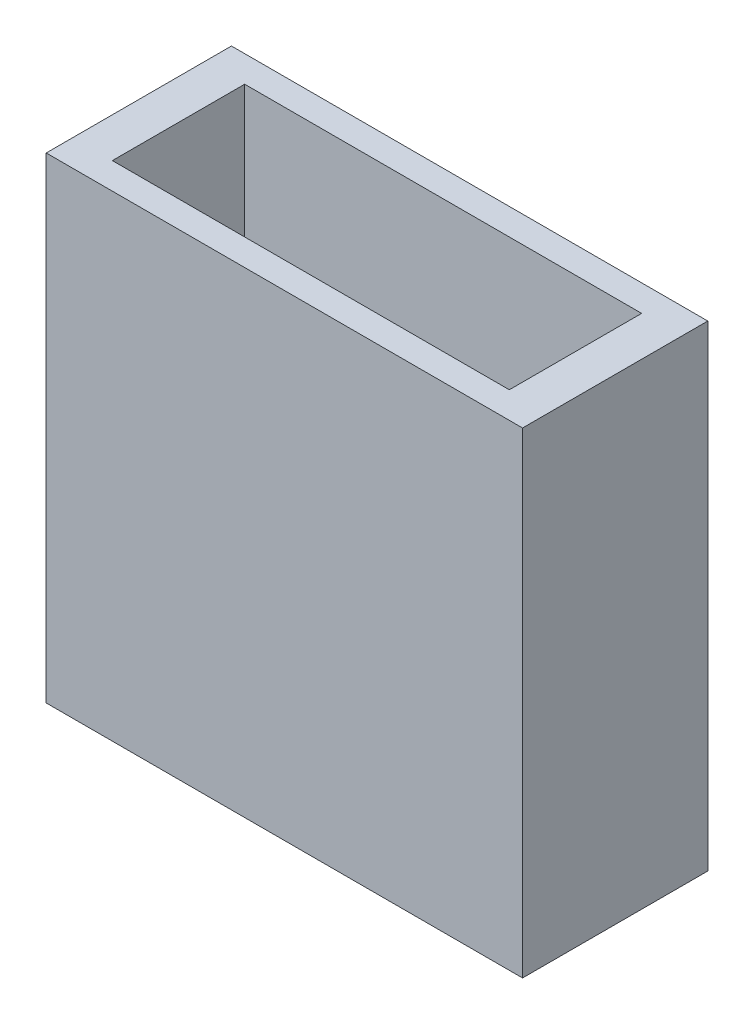
ISO-10303-21;
HEADER;
FILE_DESCRIPTION(('STEP AP214'),'2;1');
FILE_NAME('part.step','',(''),(''),'','','');
FILE_SCHEMA(('AUTOMOTIVE_DESIGN { 1 0 10303 214 1 1 1 1 }'));
ENDSEC;
DATA;
#1=APPLICATION_CONTEXT('core data for automotive mechanical design processes');
#2=APPLICATION_PROTOCOL_DEFINITION('international standard','automotive_design',2000,#1);
#3=PRODUCT_CONTEXT('',#1,'mechanical');
#4=PRODUCT('Part','Part','',(#3));
#5=PRODUCT_RELATED_PRODUCT_CATEGORY('part','',(#4));
#6=PRODUCT_DEFINITION_FORMATION('','',#4);
#7=PRODUCT_DEFINITION_CONTEXT('part definition',#1,'design');
#8=PRODUCT_DEFINITION('design','',#6,#7);
#9=PRODUCT_DEFINITION_SHAPE('','',#8);
#10=(LENGTH_UNIT() NAMED_UNIT(*) SI_UNIT(.MILLI.,.METRE.));
#11=(NAMED_UNIT(*) PLANE_ANGLE_UNIT() SI_UNIT($,.RADIAN.));
#12=(NAMED_UNIT(*) SI_UNIT($,.STERADIAN.) SOLID_ANGLE_UNIT());
#13=UNCERTAINTY_MEASURE_WITH_UNIT(LENGTH_MEASURE(1.E-05),#10,'distance_accuracy_value','');
#14=(GEOMETRIC_REPRESENTATION_CONTEXT(3) GLOBAL_UNCERTAINTY_ASSIGNED_CONTEXT((#13)) GLOBAL_UNIT_ASSIGNED_CONTEXT((#10,
#11,#12)) REPRESENTATION_CONTEXT('',''));
#15=CARTESIAN_POINT('',(0.,0.,0.));
#16=DIRECTION('',(0.,0.,1.));
#17=DIRECTION('',(1.,0.,0.));
#18=AXIS2_PLACEMENT_3D('',#15,#16,#17);
#19=CARTESIAN_POINT('',(0.,45.72,0.));
#20=DIRECTION('',(1.,0.,0.));
#21=DIRECTION('',(0.,0.,-1.));
#22=AXIS2_PLACEMENT_3D('',#19,#20,#21);
#23=PLANE('',#22);
#24=DIRECTION('',(0.,0.,1.));
#25=VECTOR('',#24,1.);
#26=CARTESIAN_POINT('',(0.,0.,0.));
#27=LINE('',#26,#25);
#28=CARTESIAN_POINT('',(0.,0.,-17.78));
#29=VERTEX_POINT('',#28);
#30=CARTESIAN_POINT('',(0.,0.,0.));
#31=VERTEX_POINT('',#30);
#32=EDGE_CURVE('E166',#29,#31,#27,.T.);
#33=ORIENTED_EDGE('',*,*,#32,.T.);
#34=DIRECTION('',(0.,-1.,0.));
#35=VECTOR('',#34,1.);
#36=CARTESIAN_POINT('',(0.,45.72,0.));
#37=LINE('',#36,#35);
#38=CARTESIAN_POINT('',(0.,45.72,0.));
#39=VERTEX_POINT('',#38);
#40=EDGE_CURVE('E11',#39,#31,#37,.T.);
#41=ORIENTED_EDGE('',*,*,#40,.F.);
#42=DIRECTION('',(0.,0.,1.));
#43=VECTOR('',#42,1.);
#44=CARTESIAN_POINT('',(0.,45.72,0.));
#45=LINE('',#44,#43);
#46=CARTESIAN_POINT('',(0.,45.72,-17.78));
#47=VERTEX_POINT('',#46);
#48=EDGE_CURVE('E172',#47,#39,#45,.T.);
#49=ORIENTED_EDGE('',*,*,#48,.F.);
#50=DIRECTION('',(0.,-1.,0.));
#51=VECTOR('',#50,1.);
#52=CARTESIAN_POINT('',(0.,45.72,-17.78));
#53=LINE('',#52,#51);
#54=EDGE_CURVE('E182',#47,#29,#53,.T.);
#55=ORIENTED_EDGE('',*,*,#54,.T.);
#56=EDGE_LOOP('',(#33,#41,#49,#55));
#57=FACE_BOUND('',#56,.T.);
#58=ADVANCED_FACE('F42',(#57),#23,.F.);
#59=CARTESIAN_POINT('',(0.,45.72,0.));
#60=DIRECTION('',(0.,0.,-1.));
#61=DIRECTION('',(-1.,0.,0.));
#62=AXIS2_PLACEMENT_3D('',#59,#60,#61);
#63=PLANE('',#62);
#64=DIRECTION('',(1.,0.,0.));
#65=VECTOR('',#64,1.);
#66=CARTESIAN_POINT('',(0.,0.,0.));
#67=LINE('',#66,#65);
#68=CARTESIAN_POINT('',(45.72,0.,0.));
#69=VERTEX_POINT('',#68);
#70=EDGE_CURVE('E186',#31,#69,#67,.T.);
#71=ORIENTED_EDGE('',*,*,#70,.T.);
#72=DIRECTION('',(0.,-1.,0.));
#73=VECTOR('',#72,1.);
#74=CARTESIAN_POINT('',(45.72,45.72,0.));
#75=LINE('',#74,#73);
#76=CARTESIAN_POINT('',(45.72,45.72,0.));
#77=VERTEX_POINT('',#76);
#78=EDGE_CURVE('E51',#77,#69,#75,.T.);
#79=ORIENTED_EDGE('',*,*,#78,.F.);
#80=DIRECTION('',(1.,0.,0.));
#81=VECTOR('',#80,1.);
#82=CARTESIAN_POINT('',(0.,45.72,0.));
#83=LINE('',#82,#81);
#84=EDGE_CURVE('E96',#39,#77,#83,.T.);
#85=ORIENTED_EDGE('',*,*,#84,.F.);
#86=ORIENTED_EDGE('',*,*,#40,.T.);
#87=EDGE_LOOP('',(#71,#79,#85,#86));
#88=FACE_BOUND('',#87,.T.);
#89=ADVANCED_FACE('F241',(#88),#63,.F.);
#90=CARTESIAN_POINT('',(45.72,45.72,0.));
#91=DIRECTION('',(-1.,0.,0.));
#92=DIRECTION('',(0.,0.,1.));
#93=AXIS2_PLACEMENT_3D('',#90,#91,#92);
#94=PLANE('',#93);
#95=DIRECTION('',(0.,0.,-1.));
#96=VECTOR('',#95,1.);
#97=CARTESIAN_POINT('',(45.72,0.,0.));
#98=LINE('',#97,#96);
#99=CARTESIAN_POINT('',(45.72,0.,-17.78));
#100=VERTEX_POINT('',#99);
#101=EDGE_CURVE('E189',#69,#100,#98,.T.);
#102=ORIENTED_EDGE('',*,*,#101,.T.);
#103=DIRECTION('',(0.,-1.,0.));
#104=VECTOR('',#103,1.);
#105=CARTESIAN_POINT('',(45.72,45.72,-17.78));
#106=LINE('',#105,#104);
#107=CARTESIAN_POINT('',(45.72,45.72,-17.78));
#108=VERTEX_POINT('',#107);
#109=EDGE_CURVE('E196',#108,#100,#106,.T.);
#110=ORIENTED_EDGE('',*,*,#109,.F.);
#111=DIRECTION('',(0.,0.,-1.));
#112=VECTOR('',#111,1.);
#113=CARTESIAN_POINT('',(45.72,45.72,0.));
#114=LINE('',#113,#112);
#115=EDGE_CURVE('E177',#77,#108,#114,.T.);
#116=ORIENTED_EDGE('',*,*,#115,.F.);
#117=ORIENTED_EDGE('',*,*,#78,.T.);
#118=EDGE_LOOP('',(#102,#110,#116,#117));
#119=FACE_BOUND('',#118,.T.);
#120=ADVANCED_FACE('F246',(#119),#94,.F.);
#121=CARTESIAN_POINT('',(0.,45.72,-17.78));
#122=DIRECTION('',(0.,0.,1.));
#123=DIRECTION('',(1.,0.,0.));
#124=AXIS2_PLACEMENT_3D('',#121,#122,#123);
#125=PLANE('',#124);
#126=DIRECTION('',(-1.,0.,0.));
#127=VECTOR('',#126,1.);
#128=CARTESIAN_POINT('',(0.,0.,-17.78));
#129=LINE('',#128,#127);
#130=EDGE_CURVE('E89',#100,#29,#129,.T.);
#131=ORIENTED_EDGE('',*,*,#130,.T.);
#132=ORIENTED_EDGE('',*,*,#54,.F.);
#133=DIRECTION('',(-1.,0.,0.));
#134=VECTOR('',#133,1.);
#135=CARTESIAN_POINT('',(0.,45.72,-17.78));
#136=LINE('',#135,#134);
#137=EDGE_CURVE('E68',#108,#47,#136,.T.);
#138=ORIENTED_EDGE('',*,*,#137,.F.);
#139=ORIENTED_EDGE('',*,*,#109,.T.);
#140=EDGE_LOOP('',(#131,#132,#138,#139));
#141=FACE_BOUND('',#140,.T.);
#142=ADVANCED_FACE('F256',(#141),#125,.F.);
#143=CARTESIAN_POINT('',(0.,45.72,0.));
#144=DIRECTION('',(0.,-1.,0.));
#145=DIRECTION('',(0.,0.,-1.));
#146=AXIS2_PLACEMENT_3D('',#143,#144,#145);
#147=PLANE('',#146);
#148=DIRECTION('',(1.,0.,0.));
#149=VECTOR('',#148,1.);
#150=CARTESIAN_POINT('',(3.81,45.72,-2.54));
#151=LINE('',#150,#149);
#152=CARTESIAN_POINT('',(3.81,45.72,-2.54));
#153=VERTEX_POINT('',#152);
#154=CARTESIAN_POINT('',(41.91,45.72,-2.54));
#155=VERTEX_POINT('',#154);
#156=EDGE_CURVE('E157',#153,#155,#151,.T.);
#157=ORIENTED_EDGE('',*,*,#156,.F.);
#158=DIRECTION('',(0.,0.,1.));
#159=VECTOR('',#158,1.);
#160=CARTESIAN_POINT('',(3.81,45.72,-2.54));
#161=LINE('',#160,#159);
#162=CARTESIAN_POINT('',(3.81,45.72,-15.24));
#163=VERTEX_POINT('',#162);
#164=EDGE_CURVE('E59',#163,#153,#161,.T.);
#165=ORIENTED_EDGE('',*,*,#164,.F.);
#166=DIRECTION('',(-1.,0.,0.));
#167=VECTOR('',#166,1.);
#168=CARTESIAN_POINT('',(3.81,45.72,-15.24));
#169=LINE('',#168,#167);
#170=CARTESIAN_POINT('',(41.91,45.72,-15.24));
#171=VERTEX_POINT('',#170);
#172=EDGE_CURVE('E141',#171,#163,#169,.T.);
#173=ORIENTED_EDGE('',*,*,#172,.F.);
#174=DIRECTION('',(0.,0.,-1.));
#175=VECTOR('',#174,1.);
#176=CARTESIAN_POINT('',(41.91,45.72,-2.54));
#177=LINE('',#176,#175);
#178=EDGE_CURVE('E145',#155,#171,#177,.T.);
#179=ORIENTED_EDGE('',*,*,#178,.F.);
#180=EDGE_LOOP('',(#157,#165,#173,#179));
#181=FACE_BOUND('',#180,.T.);
#182=ORIENTED_EDGE('',*,*,#48,.T.);
#183=ORIENTED_EDGE('',*,*,#84,.T.);
#184=ORIENTED_EDGE('',*,*,#115,.T.);
#185=ORIENTED_EDGE('',*,*,#137,.T.);
#186=EDGE_LOOP('',(#182,#183,#184,#185));
#187=FACE_BOUND('',#186,.T.);
#188=ADVANCED_FACE('F254',(#181,#187),#147,.F.);
#189=CARTESIAN_POINT('',(0.,0.,0.));
#190=DIRECTION('',(0.,-1.,0.));
#191=DIRECTION('',(0.,0.,-1.));
#192=AXIS2_PLACEMENT_3D('',#189,#190,#191);
#193=PLANE('',#192);
#194=CARTESIAN_POINT('',(29.7037039670805,0.,-8.88617054379551));
#195=DIRECTION('',(0.,-1.,0.));
#196=DIRECTION('',(-0.987688340595138,0.,-0.156434465040228));
#197=AXIS2_PLACEMENT_3D('',#194,#195,#196);
#198=ELLIPSE('',#197,3.10119923025932,3.048);
#199=CARTESIAN_POINT('',(26.6406856454908,0.,-9.37130498636429));
#200=VERTEX_POINT('',#199);
#201=EDGE_CURVE('E148',#200,#200,#198,.F.);
#202=ORIENTED_EDGE('',*,*,#201,.T.);
#203=EDGE_LOOP('',(#202));
#204=FACE_BOUND('',#203,.T.);
#205=CARTESIAN_POINT('',(15.2376722800284,0.,-8.88617054379551));
#206=DIRECTION('',(0.,-1.,0.));
#207=DIRECTION('',(-0.987688340595138,0.,-0.156434465040228));
#208=AXIS2_PLACEMENT_3D('',#205,#206,#207);
#209=ELLIPSE('',#208,3.10119923025932,3.048);
#210=CARTESIAN_POINT('',(12.1746539584387,0.,-9.37130498636429));
#211=VERTEX_POINT('',#210);
#212=EDGE_CURVE('E209',#211,#211,#209,.F.);
#213=ORIENTED_EDGE('',*,*,#212,.T.);
#214=EDGE_LOOP('',(#213));
#215=FACE_BOUND('',#214,.T.);
#216=CARTESIAN_POINT('',(22.4706881235545,0.,-8.88617054379551));
#217=DIRECTION('',(0.,-1.,0.));
#218=DIRECTION('',(-0.987688340595138,0.,-0.156434465040228));
#219=AXIS2_PLACEMENT_3D('',#216,#217,#218);
#220=ELLIPSE('',#219,3.10119923025931,3.04799999999999);
#221=CARTESIAN_POINT('',(19.4076698019647,0.,-9.37130498636429));
#222=VERTEX_POINT('',#221);
#223=EDGE_CURVE('E205',#222,#222,#220,.F.);
#224=ORIENTED_EDGE('',*,*,#223,.T.);
#225=EDGE_LOOP('',(#224));
#226=FACE_BOUND('',#225,.T.);
#227=ORIENTED_EDGE('',*,*,#32,.F.);
#228=ORIENTED_EDGE('',*,*,#130,.F.);
#229=ORIENTED_EDGE('',*,*,#101,.F.);
#230=ORIENTED_EDGE('',*,*,#70,.F.);
#231=EDGE_LOOP('',(#227,#228,#229,#230));
#232=FACE_BOUND('',#231,.T.);
#233=ADVANCED_FACE('F219',(#204,#215,#226,#232),#193,.T.);
#234=CARTESIAN_POINT('',(3.81,3.81,-2.54));
#235=DIRECTION('',(-1.,0.,0.));
#236=DIRECTION('',(0.,0.,1.));
#237=AXIS2_PLACEMENT_3D('',#234,#235,#236);
#238=PLANE('',#237);
#239=ORIENTED_EDGE('',*,*,#164,.T.);
#240=DIRECTION('',(0.,1.,0.));
#241=VECTOR('',#240,1.);
#242=CARTESIAN_POINT('',(3.81,3.81,-2.54));
#243=LINE('',#242,#241);
#244=CARTESIAN_POINT('',(3.81,3.81,-2.54));
#245=VERTEX_POINT('',#244);
#246=EDGE_CURVE('E116',#245,#153,#243,.T.);
#247=ORIENTED_EDGE('',*,*,#246,.F.);
#248=DIRECTION('',(0.,0.,1.));
#249=VECTOR('',#248,1.);
#250=CARTESIAN_POINT('',(3.81,3.81,-2.54));
#251=LINE('',#250,#249);
#252=CARTESIAN_POINT('',(3.81,3.81,-15.24));
#253=VERTEX_POINT('',#252);
#254=EDGE_CURVE('E120',#253,#245,#251,.T.);
#255=ORIENTED_EDGE('',*,*,#254,.F.);
#256=DIRECTION('',(0.,1.,0.));
#257=VECTOR('',#256,1.);
#258=CARTESIAN_POINT('',(3.81,3.81,-15.24));
#259=LINE('',#258,#257);
#260=EDGE_CURVE('E163',#253,#163,#259,.T.);
#261=ORIENTED_EDGE('',*,*,#260,.T.);
#262=EDGE_LOOP('',(#239,#247,#255,#261));
#263=FACE_BOUND('',#262,.T.);
#264=ADVANCED_FACE('F118',(#263),#238,.F.);
#265=CARTESIAN_POINT('',(3.81,3.81,-15.24));
#266=DIRECTION('',(0.,0.,-1.));
#267=DIRECTION('',(-1.,0.,0.));
#268=AXIS2_PLACEMENT_3D('',#265,#266,#267);
#269=PLANE('',#268);
#270=ORIENTED_EDGE('',*,*,#172,.T.);
#271=ORIENTED_EDGE('',*,*,#260,.F.);
#272=DIRECTION('',(-1.,0.,0.));
#273=VECTOR('',#272,1.);
#274=CARTESIAN_POINT('',(3.81,3.81,-15.24));
#275=LINE('',#274,#273);
#276=CARTESIAN_POINT('',(41.91,3.81,-15.24));
#277=VERTEX_POINT('',#276);
#278=EDGE_CURVE('E127',#277,#253,#275,.T.);
#279=ORIENTED_EDGE('',*,*,#278,.F.);
#280=DIRECTION('',(0.,1.,0.));
#281=VECTOR('',#280,1.);
#282=CARTESIAN_POINT('',(41.91,3.81,-15.24));
#283=LINE('',#282,#281);
#284=EDGE_CURVE('E167',#277,#171,#283,.T.);
#285=ORIENTED_EDGE('',*,*,#284,.T.);
#286=EDGE_LOOP('',(#270,#271,#279,#285));
#287=FACE_BOUND('',#286,.T.);
#288=ADVANCED_FACE('F297',(#287),#269,.F.);
#289=CARTESIAN_POINT('',(41.91,3.81,-2.54));
#290=DIRECTION('',(1.,0.,0.));
#291=DIRECTION('',(0.,0.,-1.));
#292=AXIS2_PLACEMENT_3D('',#289,#290,#291);
#293=PLANE('',#292);
#294=ORIENTED_EDGE('',*,*,#178,.T.);
#295=ORIENTED_EDGE('',*,*,#284,.F.);
#296=DIRECTION('',(0.,0.,-1.));
#297=VECTOR('',#296,1.);
#298=CARTESIAN_POINT('',(41.91,3.81,-2.54));
#299=LINE('',#298,#297);
#300=CARTESIAN_POINT('',(41.91,3.81,-2.54));
#301=VERTEX_POINT('',#300);
#302=EDGE_CURVE('E136',#301,#277,#299,.T.);
#303=ORIENTED_EDGE('',*,*,#302,.F.);
#304=DIRECTION('',(0.,1.,0.));
#305=VECTOR('',#304,1.);
#306=CARTESIAN_POINT('',(41.91,3.81,-2.54));
#307=LINE('',#306,#305);
#308=EDGE_CURVE('E126',#301,#155,#307,.T.);
#309=ORIENTED_EDGE('',*,*,#308,.T.);
#310=EDGE_LOOP('',(#294,#295,#303,#309));
#311=FACE_BOUND('',#310,.T.);
#312=ADVANCED_FACE('F235',(#311),#293,.F.);
#313=CARTESIAN_POINT('',(3.81,3.81,-2.54));
#314=DIRECTION('',(0.,0.,1.));
#315=DIRECTION('',(1.,0.,0.));
#316=AXIS2_PLACEMENT_3D('',#313,#314,#315);
#317=PLANE('',#316);
#318=ORIENTED_EDGE('',*,*,#156,.T.);
#319=ORIENTED_EDGE('',*,*,#308,.F.);
#320=DIRECTION('',(1.,0.,0.));
#321=VECTOR('',#320,1.);
#322=CARTESIAN_POINT('',(3.81,3.81,-2.54));
#323=LINE('',#322,#321);
#324=EDGE_CURVE('E130',#245,#301,#323,.T.);
#325=ORIENTED_EDGE('',*,*,#324,.F.);
#326=ORIENTED_EDGE('',*,*,#246,.T.);
#327=EDGE_LOOP('',(#318,#319,#325,#326));
#328=FACE_BOUND('',#327,.T.);
#329=ADVANCED_FACE('F131',(#328),#317,.F.);
#330=CARTESIAN_POINT('',(0.,3.81,0.));
#331=DIRECTION('',(0.,-1.,0.));
#332=DIRECTION('',(0.,0.,-1.));
#333=AXIS2_PLACEMENT_3D('',#330,#331,#332);
#334=PLANE('',#333);
#335=CARTESIAN_POINT('',(28.9975622058914,3.81,-8.99801241143123));
#336=DIRECTION('',(0.,-1.,0.));
#337=DIRECTION('',(-0.987688340595138,0.,-0.156434465040228));
#338=AXIS2_PLACEMENT_3D('',#335,#336,#337);
#339=ELLIPSE('',#338,3.10119923025932,3.048);
#340=CARTESIAN_POINT('',(25.9345438843016,3.81,-9.48314685400002));
#341=VERTEX_POINT('',#340);
#342=EDGE_CURVE('E45',#341,#341,#339,.F.);
#343=ORIENTED_EDGE('',*,*,#342,.F.);
#344=EDGE_LOOP('',(#343));
#345=FACE_BOUND('',#344,.T.);
#346=CARTESIAN_POINT('',(14.5315305188393,3.81,-8.99801241143123));
#347=DIRECTION('',(0.,-1.,0.));
#348=DIRECTION('',(-0.987688340595138,0.,-0.156434465040228));
#349=AXIS2_PLACEMENT_3D('',#346,#347,#348);
#350=ELLIPSE('',#349,3.10119923025932,3.048);
#351=CARTESIAN_POINT('',(11.4685121972495,3.81,-9.48314685400001));
#352=VERTEX_POINT('',#351);
#353=EDGE_CURVE('E206',#352,#352,#350,.F.);
#354=ORIENTED_EDGE('',*,*,#353,.F.);
#355=EDGE_LOOP('',(#354));
#356=FACE_BOUND('',#355,.T.);
#357=CARTESIAN_POINT('',(21.7645463623653,3.81,-8.99801241143123));
#358=DIRECTION('',(0.,-1.,0.));
#359=DIRECTION('',(-0.987688340595138,0.,-0.156434465040228));
#360=AXIS2_PLACEMENT_3D('',#357,#358,#359);
#361=ELLIPSE('',#360,3.10119923025931,3.04799999999999);
#362=CARTESIAN_POINT('',(18.7015280407756,3.81,-9.48314685400001));
#363=VERTEX_POINT('',#362);
#364=EDGE_CURVE('E202',#363,#363,#361,.F.);
#365=ORIENTED_EDGE('',*,*,#364,.F.);
#366=EDGE_LOOP('',(#365));
#367=FACE_BOUND('',#366,.T.);
#368=ORIENTED_EDGE('',*,*,#254,.T.);
#369=ORIENTED_EDGE('',*,*,#324,.T.);
#370=ORIENTED_EDGE('',*,*,#302,.T.);
#371=ORIENTED_EDGE('',*,*,#278,.T.);
#372=EDGE_LOOP('',(#368,#369,#370,#371));
#373=FACE_BOUND('',#372,.T.);
#374=ADVANCED_FACE('F138',(#345,#356,#367,#373),#334,.F.);
#375=CARTESIAN_POINT('',(23.2888516987593,-4.41441562142005,-8.75658616384277));
#376=DIRECTION('',(-0.182159663732433,0.982845594136539,-0.0288512563899666));
#377=DIRECTION('',(-0.983254907563954,-0.182235525492148,0.));
#378=AXIS2_PLACEMENT_3D('',#375,#376,#377);
#379=CYLINDRICAL_SURFACE('',#378,3.04799999999999);
#380=ORIENTED_EDGE('',*,*,#223,.F.);
#381=EDGE_LOOP('',(#380));
#382=FACE_BOUND('',#381,.T.);
#383=ORIENTED_EDGE('',*,*,#364,.T.);
#384=EDGE_LOOP('',(#383));
#385=FACE_BOUND('',#384,.T.);
#386=ADVANCED_FACE('F222',(#382,#385),#379,.F.);
#387=CARTESIAN_POINT('',(16.2958428219334,-5.70937733220705,-8.71857279474797));
#388=DIRECTION('',(-0.182159663732433,0.982845594136539,-0.0288512563899666));
#389=DIRECTION('',(-0.983254907563954,-0.182235525492148,0.));
#390=AXIS2_PLACEMENT_3D('',#387,#388,#389);
#391=CYLINDRICAL_SURFACE('',#390,3.048);
#392=ORIENTED_EDGE('',*,*,#212,.F.);
#393=EDGE_LOOP('',(#392));
#394=FACE_BOUND('',#393,.T.);
#395=ORIENTED_EDGE('',*,*,#353,.T.);
#396=EDGE_LOOP('',(#395));
#397=FACE_BOUND('',#396,.T.);
#398=ADVANCED_FACE('F225',(#394,#397),#391,.F.);
#399=CARTESIAN_POINT('',(30.2818605755852,-3.11945391063304,-8.79459953293757));
#400=DIRECTION('',(-0.182159663732433,0.982845594136539,-0.0288512563899666));
#401=DIRECTION('',(-0.983254907563954,-0.182235525492148,0.));
#402=AXIS2_PLACEMENT_3D('',#399,#400,#401);
#403=CYLINDRICAL_SURFACE('',#402,3.048);
#404=ORIENTED_EDGE('',*,*,#201,.F.);
#405=EDGE_LOOP('',(#404));
#406=FACE_BOUND('',#405,.T.);
#407=ORIENTED_EDGE('',*,*,#342,.T.);
#408=EDGE_LOOP('',(#407));
#409=FACE_BOUND('',#408,.T.);
#410=ADVANCED_FACE('F341',(#406,#409),#403,.F.);
#411=CLOSED_SHELL('',(#58,#89,#120,#142,#188,#233,#264,#288,#312,#329,#374,#386,#398,#410));
#412=MANIFOLD_SOLID_BREP('B2',#411);
#413=ADVANCED_BREP_SHAPE_REPRESENTATION('',(#18,#412),#14);
#414=SHAPE_DEFINITION_REPRESENTATION(#9,#413);
ENDSEC;
END-ISO-10303-21;
